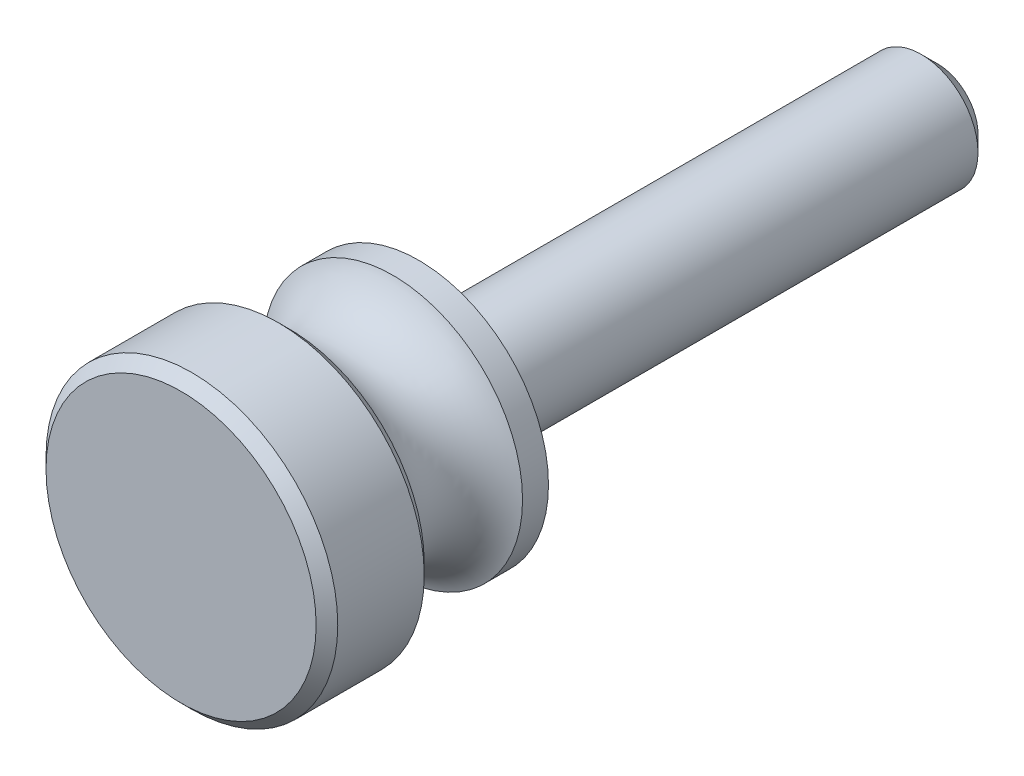
ISO-10303-21;
HEADER;
FILE_DESCRIPTION(('STEP AP214'),'2;1');
FILE_NAME('part.step','',(''),(''),'','','');
FILE_SCHEMA(('AUTOMOTIVE_DESIGN { 1 0 10303 214 1 1 1 1 }'));
ENDSEC;
DATA;
#1=APPLICATION_CONTEXT('core data for automotive mechanical design processes');
#2=APPLICATION_PROTOCOL_DEFINITION('international standard','automotive_design',2000,#1);
#3=PRODUCT_CONTEXT('',#1,'mechanical');
#4=PRODUCT('Part','Part','',(#3));
#5=PRODUCT_RELATED_PRODUCT_CATEGORY('part','',(#4));
#6=PRODUCT_DEFINITION_FORMATION('','',#4);
#7=PRODUCT_DEFINITION_CONTEXT('part definition',#1,'design');
#8=PRODUCT_DEFINITION('design','',#6,#7);
#9=PRODUCT_DEFINITION_SHAPE('','',#8);
#10=(LENGTH_UNIT() NAMED_UNIT(*) SI_UNIT(.MILLI.,.METRE.));
#11=(NAMED_UNIT(*) PLANE_ANGLE_UNIT() SI_UNIT($,.RADIAN.));
#12=(NAMED_UNIT(*) SI_UNIT($,.STERADIAN.) SOLID_ANGLE_UNIT());
#13=UNCERTAINTY_MEASURE_WITH_UNIT(LENGTH_MEASURE(1.E-05),#10,'distance_accuracy_value','');
#14=(GEOMETRIC_REPRESENTATION_CONTEXT(3) GLOBAL_UNCERTAINTY_ASSIGNED_CONTEXT((#13)) GLOBAL_UNIT_ASSIGNED_CONTEXT((#10,
#11,#12)) REPRESENTATION_CONTEXT('',''));
#15=CARTESIAN_POINT('',(0.,0.,0.));
#16=DIRECTION('',(0.,0.,1.));
#17=DIRECTION('',(1.,0.,0.));
#18=AXIS2_PLACEMENT_3D('',#15,#16,#17);
#19=CARTESIAN_POINT('',(0.,0.,4.7625));
#20=DIRECTION('',(0.,0.,-1.));
#21=DIRECTION('',(-1.,0.,0.));
#22=AXIS2_PLACEMENT_3D('',#19,#20,#21);
#23=CYLINDRICAL_SURFACE('',#22,4.7625);
#24=CARTESIAN_POINT('',(0.,0.,0.));
#25=DIRECTION('',(0.,0.,1.));
#26=DIRECTION('',(1.,0.,0.));
#27=AXIS2_PLACEMENT_3D('',#24,#25,#26);
#28=CIRCLE('',#27,4.7625);
#29=CARTESIAN_POINT('',(4.7625,0.,0.));
#30=VERTEX_POINT('',#29);
#31=EDGE_CURVE('E62',#30,#30,#28,.T.);
#32=ORIENTED_EDGE('',*,*,#31,.T.);
#33=EDGE_LOOP('',(#32));
#34=FACE_BOUND('',#33,.T.);
#35=CARTESIAN_POINT('',(0.,0.,0.952500000000004));
#36=DIRECTION('',(0.,0.,1.));
#37=DIRECTION('',(1.,0.,0.));
#38=AXIS2_PLACEMENT_3D('',#35,#36,#37);
#39=CIRCLE('',#38,4.7625);
#40=CARTESIAN_POINT('',(4.7625,0.,0.952500000000004));
#41=VERTEX_POINT('',#40);
#42=EDGE_CURVE('E65',#41,#41,#39,.T.);
#43=ORIENTED_EDGE('',*,*,#42,.F.);
#44=EDGE_LOOP('',(#43));
#45=FACE_BOUND('',#44,.T.);
#46=ADVANCED_FACE('F33',(#34,#45),#23,.T.);
#47=CARTESIAN_POINT('',(0.,0.,-19.05));
#48=DIRECTION('',(0.,0.,1.));
#49=DIRECTION('',(1.,0.,0.));
#50=AXIS2_PLACEMENT_3D('',#47,#48,#49);
#51=CYLINDRICAL_SURFACE('',#50,2.0828);
#52=CARTESIAN_POINT('',(0.,0.,-18.4546875));
#53=DIRECTION('',(0.,0.,1.));
#54=DIRECTION('',(1.,0.,0.));
#55=AXIS2_PLACEMENT_3D('',#52,#53,#54);
#56=CIRCLE('',#55,2.0828);
#57=CARTESIAN_POINT('',(2.0828,0.,-18.4546875));
#58=VERTEX_POINT('',#57);
#59=EDGE_CURVE('E56',#58,#58,#56,.T.);
#60=ORIENTED_EDGE('',*,*,#59,.T.);
#61=EDGE_LOOP('',(#60));
#62=FACE_BOUND('',#61,.T.);
#63=CARTESIAN_POINT('',(0.,0.,0.));
#64=DIRECTION('',(0.,0.,1.));
#65=DIRECTION('',(1.,0.,0.));
#66=AXIS2_PLACEMENT_3D('',#63,#64,#65);
#67=CIRCLE('',#66,2.0828);
#68=CARTESIAN_POINT('',(2.0828,0.,0.));
#69=VERTEX_POINT('',#68);
#70=EDGE_CURVE('E59',#69,#69,#67,.T.);
#71=ORIENTED_EDGE('',*,*,#70,.F.);
#72=EDGE_LOOP('',(#71));
#73=FACE_BOUND('',#72,.T.);
#74=ADVANCED_FACE('F90',(#62,#73),#51,.T.);
#75=CARTESIAN_POINT('',(0.,0.,-19.05));
#76=DIRECTION('',(0.,0.,1.));
#77=DIRECTION('',(1.,0.,0.));
#78=AXIS2_PLACEMENT_3D('',#75,#76,#77);
#79=PLANE('',#78);
#80=CARTESIAN_POINT('',(0.,0.,-19.05));
#81=DIRECTION('',(0.,0.,1.));
#82=DIRECTION('',(1.,0.,0.));
#83=AXIS2_PLACEMENT_3D('',#80,#81,#82);
#84=CIRCLE('',#83,1.48748749999999);
#85=CARTESIAN_POINT('',(1.48748749999999,0.,-19.05));
#86=VERTEX_POINT('',#85);
#87=EDGE_CURVE('E53',#86,#86,#84,.F.);
#88=ORIENTED_EDGE('',*,*,#87,.T.);
#89=EDGE_LOOP('',(#88));
#90=FACE_BOUND('',#89,.T.);
#91=ADVANCED_FACE('F96',(#90),#79,.F.);
#92=CARTESIAN_POINT('',(0.,0.,-18.4546875));
#93=DIRECTION('',(0.,0.,1.));
#94=DIRECTION('',(1.,0.,0.));
#95=AXIS2_PLACEMENT_3D('',#92,#93,#94);
#96=CONICAL_SURFACE('',#95,2.0828,0.785398163397452);
#97=ORIENTED_EDGE('',*,*,#87,.F.);
#98=EDGE_LOOP('',(#97));
#99=FACE_BOUND('',#98,.T.);
#100=ORIENTED_EDGE('',*,*,#59,.F.);
#101=EDGE_LOOP('',(#100));
#102=FACE_BOUND('',#101,.T.);
#103=ADVANCED_FACE('F86',(#99,#102),#96,.T.);
#104=CARTESIAN_POINT('',(0.,0.,0.));
#105=DIRECTION('',(0.,0.,1.));
#106=DIRECTION('',(1.,0.,0.));
#107=AXIS2_PLACEMENT_3D('',#104,#105,#106);
#108=PLANE('',#107);
#109=ORIENTED_EDGE('',*,*,#70,.T.);
#110=EDGE_LOOP('',(#109));
#111=FACE_BOUND('',#110,.T.);
#112=ORIENTED_EDGE('',*,*,#31,.F.);
#113=EDGE_LOOP('',(#112));
#114=FACE_BOUND('',#113,.T.);
#115=ADVANCED_FACE('F77',(#111,#114),#108,.F.);
#116=CARTESIAN_POINT('',(0.,0.,2.8575));
#117=DIRECTION('',(0.,0.,1.));
#118=DIRECTION('',(1.,0.,0.));
#119=AXIS2_PLACEMENT_3D('',#116,#117,#118);
#120=TOROIDAL_SURFACE('',#119,5.476875,2.03454089185373);
#121=ORIENTED_EDGE('',*,*,#42,.T.);
#122=EDGE_LOOP('',(#121));
#123=FACE_BOUND('',#122,.T.);
#124=CARTESIAN_POINT('',(0.,0.,4.7625));
#125=DIRECTION('',(0.,0.,1.));
#126=DIRECTION('',(1.,0.,0.));
#127=AXIS2_PLACEMENT_3D('',#124,#125,#126);
#128=CIRCLE('',#127,4.7625);
#129=CARTESIAN_POINT('',(4.7625,0.,4.7625));
#130=VERTEX_POINT('',#129);
#131=EDGE_CURVE('E68',#130,#130,#128,.T.);
#132=ORIENTED_EDGE('',*,*,#131,.F.);
#133=EDGE_LOOP('',(#132));
#134=FACE_BOUND('',#133,.T.);
#135=ADVANCED_FACE('F74',(#123,#134),#120,.F.);
#136=CARTESIAN_POINT('',(0.,0.,8.73125));
#137=DIRECTION('',(0.,0.,1.));
#138=DIRECTION('',(1.,0.,0.));
#139=AXIS2_PLACEMENT_3D('',#136,#137,#138);
#140=PLANE('',#139);
#141=CARTESIAN_POINT('',(0.,0.,8.73125));
#142=DIRECTION('',(0.,0.,1.));
#143=DIRECTION('',(1.,0.,0.));
#144=AXIS2_PLACEMENT_3D('',#141,#142,#143);
#145=CIRCLE('',#144,4.9609375);
#146=CARTESIAN_POINT('',(4.9609375,0.,8.73125));
#147=VERTEX_POINT('',#146);
#148=EDGE_CURVE('E10',#147,#147,#145,.T.);
#149=ORIENTED_EDGE('',*,*,#148,.T.);
#150=EDGE_LOOP('',(#149));
#151=FACE_BOUND('',#150,.T.);
#152=ADVANCED_FACE('F76',(#151),#140,.T.);
#153=CARTESIAN_POINT('',(0.,0.,8.73125));
#154=DIRECTION('',(0.,0.,-1.));
#155=DIRECTION('',(-1.,0.,0.));
#156=AXIS2_PLACEMENT_3D('',#153,#154,#155);
#157=CYLINDRICAL_SURFACE('',#156,5.3578125);
#158=CARTESIAN_POINT('',(0.,0.,5.15937499999999));
#159=DIRECTION('',(0.,0.,1.));
#160=DIRECTION('',(1.,0.,0.));
#161=AXIS2_PLACEMENT_3D('',#158,#159,#160);
#162=CIRCLE('',#161,5.3578125);
#163=CARTESIAN_POINT('',(5.3578125,0.,5.15937499999999));
#164=VERTEX_POINT('',#163);
#165=EDGE_CURVE('E44',#164,#164,#162,.T.);
#166=ORIENTED_EDGE('',*,*,#165,.T.);
#167=EDGE_LOOP('',(#166));
#168=FACE_BOUND('',#167,.T.);
#169=CARTESIAN_POINT('',(0.,0.,8.334375));
#170=DIRECTION('',(0.,0.,1.));
#171=DIRECTION('',(1.,0.,0.));
#172=AXIS2_PLACEMENT_3D('',#169,#170,#171);
#173=CIRCLE('',#172,5.3578125);
#174=CARTESIAN_POINT('',(5.3578125,0.,8.334375));
#175=VERTEX_POINT('',#174);
#176=EDGE_CURVE('E48',#175,#175,#173,.F.);
#177=ORIENTED_EDGE('',*,*,#176,.T.);
#178=EDGE_LOOP('',(#177));
#179=FACE_BOUND('',#178,.T.);
#180=ADVANCED_FACE('F84',(#168,#179),#157,.T.);
#181=CARTESIAN_POINT('',(0.,0.,4.7625));
#182=DIRECTION('',(0.,0.,1.));
#183=DIRECTION('',(1.,0.,0.));
#184=AXIS2_PLACEMENT_3D('',#181,#182,#183);
#185=PLANE('',#184);
#186=CARTESIAN_POINT('',(0.,0.,4.7625));
#187=DIRECTION('',(0.,0.,1.));
#188=DIRECTION('',(1.,0.,0.));
#189=AXIS2_PLACEMENT_3D('',#186,#187,#188);
#190=CIRCLE('',#189,4.9609375);
#191=CARTESIAN_POINT('',(4.9609375,0.,4.7625));
#192=VERTEX_POINT('',#191);
#193=EDGE_CURVE('E40',#192,#192,#190,.F.);
#194=ORIENTED_EDGE('',*,*,#193,.T.);
#195=EDGE_LOOP('',(#194));
#196=FACE_BOUND('',#195,.T.);
#197=ORIENTED_EDGE('',*,*,#131,.T.);
#198=EDGE_LOOP('',(#197));
#199=FACE_BOUND('',#198,.T.);
#200=ADVANCED_FACE('F72',(#196,#199),#185,.F.);
#201=CARTESIAN_POINT('',(0.,0.,5.15937499999999));
#202=DIRECTION('',(0.,0.,1.));
#203=DIRECTION('',(1.,0.,0.));
#204=AXIS2_PLACEMENT_3D('',#201,#202,#203);
#205=CONICAL_SURFACE('',#204,5.3578125,0.785398163397454);
#206=ORIENTED_EDGE('',*,*,#193,.F.);
#207=EDGE_LOOP('',(#206));
#208=FACE_BOUND('',#207,.T.);
#209=ORIENTED_EDGE('',*,*,#165,.F.);
#210=EDGE_LOOP('',(#209));
#211=FACE_BOUND('',#210,.T.);
#212=ADVANCED_FACE('F107',(#208,#211),#205,.T.);
#213=CARTESIAN_POINT('',(0.,0.,8.73125));
#214=DIRECTION('',(0.,0.,-1.));
#215=DIRECTION('',(-1.,0.,0.));
#216=AXIS2_PLACEMENT_3D('',#213,#214,#215);
#217=CONICAL_SURFACE('',#216,4.9609375,0.785398163397444);
#218=ORIENTED_EDGE('',*,*,#176,.F.);
#219=EDGE_LOOP('',(#218));
#220=FACE_BOUND('',#219,.T.);
#221=ORIENTED_EDGE('',*,*,#148,.F.);
#222=EDGE_LOOP('',(#221));
#223=FACE_BOUND('',#222,.T.);
#224=ADVANCED_FACE('F35',(#220,#223),#217,.T.);
#225=CLOSED_SHELL('',(#46,#74,#91,#103,#115,#135,#152,#180,#200,#212,#224));
#226=MANIFOLD_SOLID_BREP('B2',#225);
#227=ADVANCED_BREP_SHAPE_REPRESENTATION('',(#18,#226),#14);
#228=SHAPE_DEFINITION_REPRESENTATION(#9,#227);
ENDSEC;
END-ISO-10303-21;
